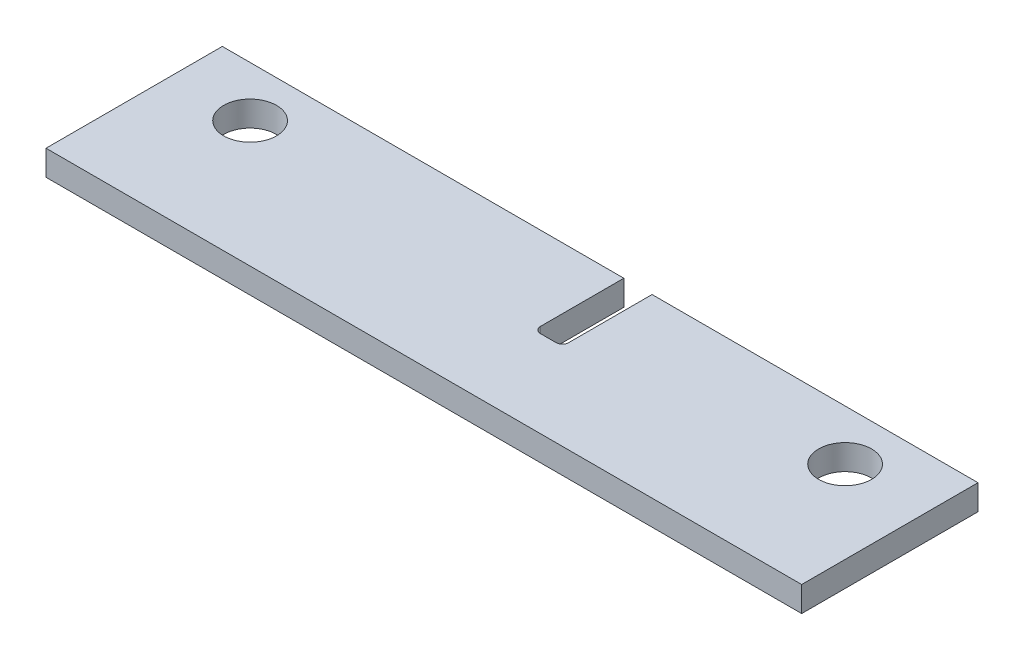
ISO-10303-21;
HEADER;
FILE_DESCRIPTION(('STEP AP214'),'2;1');
FILE_NAME('part.step','',(''),(''),'','','');
FILE_SCHEMA(('AUTOMOTIVE_DESIGN { 1 0 10303 214 1 1 1 1 }'));
ENDSEC;
DATA;
#1=APPLICATION_CONTEXT('core data for automotive mechanical design processes');
#2=APPLICATION_PROTOCOL_DEFINITION('international standard','automotive_design',2000,#1);
#3=PRODUCT_CONTEXT('',#1,'mechanical');
#4=PRODUCT('Part','Part','',(#3));
#5=PRODUCT_RELATED_PRODUCT_CATEGORY('part','',(#4));
#6=PRODUCT_DEFINITION_FORMATION('','',#4);
#7=PRODUCT_DEFINITION_CONTEXT('part definition',#1,'design');
#8=PRODUCT_DEFINITION('design','',#6,#7);
#9=PRODUCT_DEFINITION_SHAPE('','',#8);
#10=(LENGTH_UNIT() NAMED_UNIT(*) SI_UNIT(.MILLI.,.METRE.));
#11=(NAMED_UNIT(*) PLANE_ANGLE_UNIT() SI_UNIT($,.RADIAN.));
#12=(NAMED_UNIT(*) SI_UNIT($,.STERADIAN.) SOLID_ANGLE_UNIT());
#13=UNCERTAINTY_MEASURE_WITH_UNIT(LENGTH_MEASURE(1.E-05),#10,'distance_accuracy_value','');
#14=(GEOMETRIC_REPRESENTATION_CONTEXT(3) GLOBAL_UNCERTAINTY_ASSIGNED_CONTEXT((#13)) GLOBAL_UNIT_ASSIGNED_CONTEXT((#10,
#11,#12)) REPRESENTATION_CONTEXT('',''));
#15=CARTESIAN_POINT('',(0.,0.,0.));
#16=DIRECTION('',(0.,0.,1.));
#17=DIRECTION('',(1.,0.,0.));
#18=AXIS2_PLACEMENT_3D('',#15,#16,#17);
#19=CARTESIAN_POINT('',(0.,0.,249.6));
#20=DIRECTION('',(0.,0.,-1.));
#21=DIRECTION('',(-1.,0.,0.));
#22=AXIS2_PLACEMENT_3D('',#19,#20,#21);
#23=PLANE('',#22);
#24=DIRECTION('',(0.,1.,0.));
#25=VECTOR('',#24,1.);
#26=CARTESIAN_POINT('',(2477.262,115.8,249.6));
#27=LINE('',#26,#25);
#28=CARTESIAN_POINT('',(2477.262,115.8,249.6));
#29=VERTEX_POINT('',#28);
#30=CARTESIAN_POINT('',(2477.262,128.5,249.6));
#31=VERTEX_POINT('',#30);
#32=EDGE_CURVE('E156',#29,#31,#27,.T.);
#33=ORIENTED_EDGE('',*,*,#32,.T.);
#34=DIRECTION('',(-1.,0.,0.));
#35=VECTOR('',#34,1.);
#36=CARTESIAN_POINT('',(2260.6,128.5,249.6));
#37=LINE('',#36,#35);
#38=CARTESIAN_POINT('',(2641.6,128.5,249.6));
#39=VERTEX_POINT('',#38);
#40=EDGE_CURVE('E134',#39,#31,#37,.T.);
#41=ORIENTED_EDGE('',*,*,#40,.F.);
#42=DIRECTION('',(0.,1.,0.));
#43=VECTOR('',#42,1.);
#44=CARTESIAN_POINT('',(2641.6,115.8,249.6));
#45=LINE('',#44,#43);
#46=CARTESIAN_POINT('',(2641.6,115.8,249.6));
#47=VERTEX_POINT('',#46);
#48=EDGE_CURVE('E181',#47,#39,#45,.T.);
#49=ORIENTED_EDGE('',*,*,#48,.F.);
#50=DIRECTION('',(1.,0.,0.));
#51=VECTOR('',#50,1.);
#52=CARTESIAN_POINT('',(2260.6,115.8,249.6));
#53=LINE('',#52,#51);
#54=EDGE_CURVE('E204',#29,#47,#53,.T.);
#55=ORIENTED_EDGE('',*,*,#54,.F.);
#56=EDGE_LOOP('',(#33,#41,#49,#55));
#57=FACE_BOUND('',#56,.T.);
#58=ADVANCED_FACE('F45',(#57),#23,.T.);
#59=CARTESIAN_POINT('',(2260.6,115.8,249.6));
#60=DIRECTION('',(-1.,0.,0.));
#61=DIRECTION('',(0.,0.,1.));
#62=AXIS2_PLACEMENT_3D('',#59,#60,#61);
#63=PLANE('',#62);
#64=DIRECTION('',(0.,0.,1.));
#65=VECTOR('',#64,1.);
#66=CARTESIAN_POINT('',(2260.6,115.8,249.6));
#67=LINE('',#66,#65);
#68=CARTESIAN_POINT('',(2260.6,115.8,249.6));
#69=VERTEX_POINT('',#68);
#70=CARTESIAN_POINT('',(2260.6,115.8,338.5));
#71=VERTEX_POINT('',#70);
#72=EDGE_CURVE('E150',#69,#71,#67,.T.);
#73=ORIENTED_EDGE('',*,*,#72,.T.);
#74=DIRECTION('',(0.,-1.,0.));
#75=VECTOR('',#74,1.);
#76=CARTESIAN_POINT('',(2260.6,115.8,338.5));
#77=LINE('',#76,#75);
#78=CARTESIAN_POINT('',(2260.6,128.5,338.5));
#79=VERTEX_POINT('',#78);
#80=EDGE_CURVE('E141',#79,#71,#77,.T.);
#81=ORIENTED_EDGE('',*,*,#80,.F.);
#82=DIRECTION('',(0.,0.,1.));
#83=VECTOR('',#82,1.);
#84=CARTESIAN_POINT('',(2260.6,128.5,249.6));
#85=LINE('',#84,#83);
#86=CARTESIAN_POINT('',(2260.6,128.5,249.6));
#87=VERTEX_POINT('',#86);
#88=EDGE_CURVE('E125',#87,#79,#85,.T.);
#89=ORIENTED_EDGE('',*,*,#88,.F.);
#90=DIRECTION('',(0.,-1.,0.));
#91=VECTOR('',#90,1.);
#92=CARTESIAN_POINT('',(2260.6,115.8,249.6));
#93=LINE('',#92,#91);
#94=EDGE_CURVE('E139',#87,#69,#93,.T.);
#95=ORIENTED_EDGE('',*,*,#94,.T.);
#96=EDGE_LOOP('',(#73,#81,#89,#95));
#97=FACE_BOUND('',#96,.T.);
#98=ADVANCED_FACE('F138',(#97),#63,.T.);
#99=CARTESIAN_POINT('',(2260.6,128.5,249.6));
#100=DIRECTION('',(0.,1.,0.));
#101=DIRECTION('',(0.,0.,1.));
#102=AXIS2_PLACEMENT_3D('',#99,#100,#101);
#103=PLANE('',#102);
#104=CARTESIAN_POINT('',(2599.99999999996,128.5,275.));
#105=DIRECTION('',(0.,1.,0.));
#106=DIRECTION('',(0.,0.,1.));
#107=AXIS2_PLACEMENT_3D('',#104,#105,#106);
#108=CIRCLE('',#107,13.3349999999999);
#109=CARTESIAN_POINT('',(2599.99999999996,128.5,261.665));
#110=VERTEX_POINT('',#109);
#111=EDGE_CURVE('E149',#110,#110,#108,.F.);
#112=ORIENTED_EDGE('',*,*,#111,.T.);
#113=EDGE_LOOP('',(#112));
#114=FACE_BOUND('',#113,.T.);
#115=CARTESIAN_POINT('',(2299.99999999996,128.5,275.));
#116=DIRECTION('',(0.,1.,0.));
#117=DIRECTION('',(0.,0.,1.));
#118=AXIS2_PLACEMENT_3D('',#115,#116,#117);
#119=CIRCLE('',#118,13.3349999999999);
#120=CARTESIAN_POINT('',(2299.99999999996,128.5,261.665));
#121=VERTEX_POINT('',#120);
#122=EDGE_CURVE('E132',#121,#121,#119,.F.);
#123=ORIENTED_EDGE('',*,*,#122,.T.);
#124=EDGE_LOOP('',(#123));
#125=FACE_BOUND('',#124,.T.);
#126=DIRECTION('',(0.,0.,-1.));
#127=VECTOR('',#126,1.);
#128=CARTESIAN_POINT('',(2477.262,128.5,249.6));
#129=LINE('',#128,#127);
#130=CARTESIAN_POINT('',(2477.262,128.5,291.637));
#131=VERTEX_POINT('',#130);
#132=EDGE_CURVE('E164',#131,#31,#129,.T.);
#133=ORIENTED_EDGE('',*,*,#132,.F.);
#134=CARTESIAN_POINT('',(2474.087,128.5,291.637));
#135=DIRECTION('',(0.,1.,0.));
#136=DIRECTION('',(0.,0.,1.));
#137=AXIS2_PLACEMENT_3D('',#134,#135,#136);
#138=CIRCLE('',#137,3.175);
#139=CARTESIAN_POINT('',(2474.087,128.5,294.812));
#140=VERTEX_POINT('',#139);
#141=EDGE_CURVE('E225',#131,#140,#138,.F.);
#142=ORIENTED_EDGE('',*,*,#141,.T.);
#143=DIRECTION('',(1.,0.,0.));
#144=VECTOR('',#143,1.);
#145=CARTESIAN_POINT('',(2260.6,128.5,294.812000000001));
#146=LINE('',#145,#144);
#147=CARTESIAN_POINT('',(2466.213,128.5,294.812));
#148=VERTEX_POINT('',#147);
#149=EDGE_CURVE('E192',#148,#140,#146,.T.);
#150=ORIENTED_EDGE('',*,*,#149,.F.);
#151=CARTESIAN_POINT('',(2466.213,128.5,291.637));
#152=DIRECTION('',(0.,1.,0.));
#153=DIRECTION('',(0.,0.,1.));
#154=AXIS2_PLACEMENT_3D('',#151,#152,#153);
#155=CIRCLE('',#154,3.175);
#156=CARTESIAN_POINT('',(2463.038,128.5,291.637));
#157=VERTEX_POINT('',#156);
#158=EDGE_CURVE('E54',#148,#157,#155,.F.);
#159=ORIENTED_EDGE('',*,*,#158,.T.);
#160=DIRECTION('',(0.,0.,1.));
#161=VECTOR('',#160,1.);
#162=CARTESIAN_POINT('',(2463.038,128.5,249.6));
#163=LINE('',#162,#161);
#164=CARTESIAN_POINT('',(2463.038,128.5,249.6));
#165=VERTEX_POINT('',#164);
#166=EDGE_CURVE('E127',#165,#157,#163,.T.);
#167=ORIENTED_EDGE('',*,*,#166,.F.);
#168=EDGE_CURVE('E120',#165,#87,#37,.T.);
#169=ORIENTED_EDGE('',*,*,#168,.T.);
#170=ORIENTED_EDGE('',*,*,#88,.T.);
#171=DIRECTION('',(-1.,0.,0.));
#172=VECTOR('',#171,1.);
#173=CARTESIAN_POINT('',(2260.6,128.5,338.5));
#174=LINE('',#173,#172);
#175=CARTESIAN_POINT('',(2641.6,128.5,338.5));
#176=VERTEX_POINT('',#175);
#177=EDGE_CURVE('E161',#176,#79,#174,.T.);
#178=ORIENTED_EDGE('',*,*,#177,.F.);
#179=DIRECTION('',(0.,0.,1.));
#180=VECTOR('',#179,1.);
#181=CARTESIAN_POINT('',(2641.6,128.5,249.6));
#182=LINE('',#181,#180);
#183=EDGE_CURVE('E239',#39,#176,#182,.T.);
#184=ORIENTED_EDGE('',*,*,#183,.F.);
#185=ORIENTED_EDGE('',*,*,#40,.T.);
#186=EDGE_LOOP('',(#133,#142,#150,#159,#167,#169,#170,#178,#184,#185));
#187=FACE_BOUND('',#186,.T.);
#188=ADVANCED_FACE('F123',(#114,#125,#187),#103,.T.);
#189=CARTESIAN_POINT('',(2641.6,115.8,249.6));
#190=DIRECTION('',(1.,0.,0.));
#191=DIRECTION('',(0.,0.,-1.));
#192=AXIS2_PLACEMENT_3D('',#189,#190,#191);
#193=PLANE('',#192);
#194=ORIENTED_EDGE('',*,*,#183,.T.);
#195=DIRECTION('',(0.,1.,0.));
#196=VECTOR('',#195,1.);
#197=CARTESIAN_POINT('',(2641.6,115.8,338.5));
#198=LINE('',#197,#196);
#199=CARTESIAN_POINT('',(2641.6,115.8,338.5));
#200=VERTEX_POINT('',#199);
#201=EDGE_CURVE('E165',#200,#176,#198,.T.);
#202=ORIENTED_EDGE('',*,*,#201,.F.);
#203=DIRECTION('',(0.,0.,1.));
#204=VECTOR('',#203,1.);
#205=CARTESIAN_POINT('',(2641.6,115.8,249.6));
#206=LINE('',#205,#204);
#207=EDGE_CURVE('E233',#47,#200,#206,.T.);
#208=ORIENTED_EDGE('',*,*,#207,.F.);
#209=ORIENTED_EDGE('',*,*,#48,.T.);
#210=EDGE_LOOP('',(#194,#202,#208,#209));
#211=FACE_BOUND('',#210,.T.);
#212=ADVANCED_FACE('F291',(#211),#193,.T.);
#213=CARTESIAN_POINT('',(2260.6,115.8,249.6));
#214=DIRECTION('',(0.,-1.,0.));
#215=DIRECTION('',(0.,0.,-1.));
#216=AXIS2_PLACEMENT_3D('',#213,#214,#215);
#217=PLANE('',#216);
#218=CARTESIAN_POINT('',(2599.99999999996,115.8,275.));
#219=DIRECTION('',(0.,-1.,0.));
#220=DIRECTION('',(0.,0.,-1.));
#221=AXIS2_PLACEMENT_3D('',#218,#219,#220);
#222=CIRCLE('',#221,13.3349999999999);
#223=CARTESIAN_POINT('',(2599.99999999996,115.8,261.665));
#224=VERTEX_POINT('',#223);
#225=EDGE_CURVE('E176',#224,#224,#222,.F.);
#226=ORIENTED_EDGE('',*,*,#225,.T.);
#227=EDGE_LOOP('',(#226));
#228=FACE_BOUND('',#227,.T.);
#229=CARTESIAN_POINT('',(2299.99999999996,115.8,275.));
#230=DIRECTION('',(0.,-1.,0.));
#231=DIRECTION('',(0.,0.,-1.));
#232=AXIS2_PLACEMENT_3D('',#229,#230,#231);
#233=CIRCLE('',#232,13.3349999999999);
#234=CARTESIAN_POINT('',(2299.99999999996,115.8,261.665));
#235=VERTEX_POINT('',#234);
#236=EDGE_CURVE('E180',#235,#235,#233,.F.);
#237=ORIENTED_EDGE('',*,*,#236,.T.);
#238=EDGE_LOOP('',(#237));
#239=FACE_BOUND('',#238,.T.);
#240=DIRECTION('',(1.,0.,0.));
#241=VECTOR('',#240,1.);
#242=CARTESIAN_POINT('',(2476.5,115.8,294.812));
#243=LINE('',#242,#241);
#244=CARTESIAN_POINT('',(2466.213,115.8,294.812));
#245=VERTEX_POINT('',#244);
#246=CARTESIAN_POINT('',(2474.087,115.8,294.812));
#247=VERTEX_POINT('',#246);
#248=EDGE_CURVE('E174',#245,#247,#243,.T.);
#249=ORIENTED_EDGE('',*,*,#248,.T.);
#250=CARTESIAN_POINT('',(2474.087,115.8,291.637));
#251=DIRECTION('',(0.,-1.,0.));
#252=DIRECTION('',(0.,0.,-1.));
#253=AXIS2_PLACEMENT_3D('',#250,#251,#252);
#254=CIRCLE('',#253,3.175);
#255=CARTESIAN_POINT('',(2477.262,115.8,291.637));
#256=VERTEX_POINT('',#255);
#257=EDGE_CURVE('E228',#247,#256,#254,.F.);
#258=ORIENTED_EDGE('',*,*,#257,.T.);
#259=DIRECTION('',(0.,0.,-1.));
#260=VECTOR('',#259,1.);
#261=CARTESIAN_POINT('',(2477.262,115.8,249.6));
#262=LINE('',#261,#260);
#263=EDGE_CURVE('E188',#256,#29,#262,.T.);
#264=ORIENTED_EDGE('',*,*,#263,.T.);
#265=ORIENTED_EDGE('',*,*,#54,.T.);
#266=ORIENTED_EDGE('',*,*,#207,.T.);
#267=DIRECTION('',(1.,0.,0.));
#268=VECTOR('',#267,1.);
#269=CARTESIAN_POINT('',(2260.6,115.8,338.5));
#270=LINE('',#269,#268);
#271=EDGE_CURVE('E169',#71,#200,#270,.T.);
#272=ORIENTED_EDGE('',*,*,#271,.F.);
#273=ORIENTED_EDGE('',*,*,#72,.F.);
#274=CARTESIAN_POINT('',(2463.038,115.8,249.6));
#275=VERTEX_POINT('',#274);
#276=EDGE_CURVE('E147',#69,#275,#53,.T.);
#277=ORIENTED_EDGE('',*,*,#276,.T.);
#278=DIRECTION('',(0.,0.,1.));
#279=VECTOR('',#278,1.);
#280=CARTESIAN_POINT('',(2463.038,115.8,294.05));
#281=LINE('',#280,#279);
#282=CARTESIAN_POINT('',(2463.038,115.8,291.637));
#283=VERTEX_POINT('',#282);
#284=EDGE_CURVE('E196',#275,#283,#281,.T.);
#285=ORIENTED_EDGE('',*,*,#284,.T.);
#286=CARTESIAN_POINT('',(2466.213,115.8,291.637));
#287=DIRECTION('',(0.,-1.,0.));
#288=DIRECTION('',(0.,0.,-1.));
#289=AXIS2_PLACEMENT_3D('',#286,#287,#288);
#290=CIRCLE('',#289,3.175);
#291=EDGE_CURVE('E12',#283,#245,#290,.F.);
#292=ORIENTED_EDGE('',*,*,#291,.T.);
#293=EDGE_LOOP('',(#249,#258,#264,#265,#266,#272,#273,#277,#285,#292));
#294=FACE_BOUND('',#293,.T.);
#295=ADVANCED_FACE('F263',(#228,#239,#294),#217,.T.);
#296=DIRECTION('',(0.,1.,0.));
#297=VECTOR('',#296,1.);
#298=CARTESIAN_POINT('',(2463.038,0.,249.6));
#299=LINE('',#298,#297);
#300=EDGE_CURVE('E191',#275,#165,#299,.T.);
#301=ORIENTED_EDGE('',*,*,#300,.F.);
#302=ORIENTED_EDGE('',*,*,#276,.F.);
#303=ORIENTED_EDGE('',*,*,#94,.F.);
#304=ORIENTED_EDGE('',*,*,#168,.F.);
#305=EDGE_LOOP('',(#301,#302,#303,#304));
#306=FACE_BOUND('',#305,.T.);
#307=ADVANCED_FACE('F145',(#306),#23,.T.);
#308=CARTESIAN_POINT('',(0.,0.,338.5));
#309=DIRECTION('',(0.,0.,-1.));
#310=DIRECTION('',(-1.,0.,0.));
#311=AXIS2_PLACEMENT_3D('',#308,#309,#310);
#312=PLANE('',#311);
#313=ORIENTED_EDGE('',*,*,#80,.T.);
#314=ORIENTED_EDGE('',*,*,#271,.T.);
#315=ORIENTED_EDGE('',*,*,#201,.T.);
#316=ORIENTED_EDGE('',*,*,#177,.T.);
#317=EDGE_LOOP('',(#313,#314,#315,#316));
#318=FACE_BOUND('',#317,.T.);
#319=ADVANCED_FACE('F285',(#318),#312,.F.);
#320=CARTESIAN_POINT('',(2477.262,115.8,249.6));
#321=DIRECTION('',(1.,0.,0.));
#322=DIRECTION('',(0.,0.,-1.));
#323=AXIS2_PLACEMENT_3D('',#320,#321,#322);
#324=PLANE('',#323);
#325=ORIENTED_EDGE('',*,*,#263,.F.);
#326=DIRECTION('',(0.,1.,0.));
#327=VECTOR('',#326,1.);
#328=CARTESIAN_POINT('',(2477.262,128.5,291.637));
#329=LINE('',#328,#327);
#330=EDGE_CURVE('E195',#256,#131,#329,.T.);
#331=ORIENTED_EDGE('',*,*,#330,.T.);
#332=ORIENTED_EDGE('',*,*,#132,.T.);
#333=ORIENTED_EDGE('',*,*,#32,.F.);
#334=EDGE_LOOP('',(#325,#331,#332,#333));
#335=FACE_BOUND('',#334,.T.);
#336=ADVANCED_FACE('F250',(#335),#324,.F.);
#337=CARTESIAN_POINT('',(2476.5,115.8,294.812));
#338=DIRECTION('',(0.,0.,1.));
#339=DIRECTION('',(1.,0.,0.));
#340=AXIS2_PLACEMENT_3D('',#337,#338,#339);
#341=PLANE('',#340);
#342=ORIENTED_EDGE('',*,*,#149,.T.);
#343=DIRECTION('',(0.,1.,0.));
#344=VECTOR('',#343,1.);
#345=CARTESIAN_POINT('',(2474.087,115.8,294.812));
#346=LINE('',#345,#344);
#347=EDGE_CURVE('E220',#140,#247,#346,.F.);
#348=ORIENTED_EDGE('',*,*,#347,.T.);
#349=ORIENTED_EDGE('',*,*,#248,.F.);
#350=DIRECTION('',(0.,1.,0.));
#351=VECTOR('',#350,1.);
#352=CARTESIAN_POINT('',(2466.213,128.5,294.812));
#353=LINE('',#352,#351);
#354=EDGE_CURVE('E216',#245,#148,#353,.T.);
#355=ORIENTED_EDGE('',*,*,#354,.T.);
#356=EDGE_LOOP('',(#342,#348,#349,#355));
#357=FACE_BOUND('',#356,.T.);
#358=ADVANCED_FACE('F257',(#357),#341,.F.);
#359=CARTESIAN_POINT('',(2463.038,115.8,294.05));
#360=DIRECTION('',(-1.,0.,0.));
#361=DIRECTION('',(0.,0.,1.));
#362=AXIS2_PLACEMENT_3D('',#359,#360,#361);
#363=PLANE('',#362);
#364=ORIENTED_EDGE('',*,*,#166,.T.);
#365=DIRECTION('',(0.,1.,0.));
#366=VECTOR('',#365,1.);
#367=CARTESIAN_POINT('',(2463.038,115.8,291.637));
#368=LINE('',#367,#366);
#369=EDGE_CURVE('E61',#157,#283,#368,.F.);
#370=ORIENTED_EDGE('',*,*,#369,.T.);
#371=ORIENTED_EDGE('',*,*,#284,.F.);
#372=ORIENTED_EDGE('',*,*,#300,.T.);
#373=EDGE_LOOP('',(#364,#370,#371,#372));
#374=FACE_BOUND('',#373,.T.);
#375=ADVANCED_FACE('F264',(#374),#363,.F.);
#376=CARTESIAN_POINT('',(2299.99999999996,181.249999999996,275.));
#377=DIRECTION('',(0.,-1.,0.));
#378=DIRECTION('',(0.,0.,-1.));
#379=AXIS2_PLACEMENT_3D('',#376,#377,#378);
#380=CYLINDRICAL_SURFACE('',#379,13.3349999999999);
#381=CARTESIAN_POINT('',(2299.99999999996,128.5,261.665));
#382=CARTESIAN_POINT('',(2299.99999999996,128.367708333333,261.665));
#383=CARTESIAN_POINT('',(2299.99999999996,128.235416666667,261.665));
#384=CARTESIAN_POINT('',(2299.99999999996,127.970833333333,261.665));
#385=CARTESIAN_POINT('',(2299.99999999996,127.838541666667,261.665));
#386=CARTESIAN_POINT('',(2299.99999999996,127.573958333333,261.665));
#387=CARTESIAN_POINT('',(2299.99999999996,127.441666666667,261.665));
#388=CARTESIAN_POINT('',(2299.99999999996,127.177083333333,261.665));
#389=CARTESIAN_POINT('',(2299.99999999996,127.044791666667,261.665));
#390=CARTESIAN_POINT('',(2299.99999999996,126.780208333333,261.665));
#391=CARTESIAN_POINT('',(2299.99999999996,126.647916666667,261.665));
#392=CARTESIAN_POINT('',(2299.99999999996,126.383333333333,261.665));
#393=CARTESIAN_POINT('',(2299.99999999996,126.251041666667,261.665));
#394=CARTESIAN_POINT('',(2299.99999999996,125.986458333333,261.665));
#395=CARTESIAN_POINT('',(2299.99999999996,125.854166666667,261.665));
#396=CARTESIAN_POINT('',(2299.99999999996,125.589583333333,261.665));
#397=CARTESIAN_POINT('',(2299.99999999996,125.457291666667,261.665));
#398=CARTESIAN_POINT('',(2299.99999999996,125.192708333333,261.665));
#399=CARTESIAN_POINT('',(2299.99999999996,125.060416666667,261.665));
#400=CARTESIAN_POINT('',(2299.99999999996,124.795833333333,261.665));
#401=CARTESIAN_POINT('',(2299.99999999996,124.663541666667,261.665));
#402=CARTESIAN_POINT('',(2299.99999999996,124.398958333333,261.665));
#403=CARTESIAN_POINT('',(2299.99999999996,124.266666666667,261.665));
#404=CARTESIAN_POINT('',(2299.99999999996,124.002083333333,261.665));
#405=CARTESIAN_POINT('',(2299.99999999996,123.869791666667,261.665));
#406=CARTESIAN_POINT('',(2299.99999999996,123.605208333333,261.665));
#407=CARTESIAN_POINT('',(2299.99999999996,123.472916666667,261.665));
#408=CARTESIAN_POINT('',(2299.99999999996,123.208333333333,261.665));
#409=CARTESIAN_POINT('',(2299.99999999996,123.076041666667,261.665));
#410=CARTESIAN_POINT('',(2299.99999999996,122.811458333333,261.665));
#411=CARTESIAN_POINT('',(2299.99999999996,122.679166666667,261.665));
#412=CARTESIAN_POINT('',(2299.99999999996,122.414583333333,261.665));
#413=CARTESIAN_POINT('',(2299.99999999996,122.282291666667,261.665));
#414=CARTESIAN_POINT('',(2299.99999999996,122.017708333333,261.665));
#415=CARTESIAN_POINT('',(2299.99999999996,121.885416666667,261.665));
#416=CARTESIAN_POINT('',(2299.99999999996,121.620833333333,261.665));
#417=CARTESIAN_POINT('',(2299.99999999996,121.488541666667,261.665));
#418=CARTESIAN_POINT('',(2299.99999999996,121.223958333333,261.665));
#419=CARTESIAN_POINT('',(2299.99999999996,121.091666666667,261.665));
#420=CARTESIAN_POINT('',(2299.99999999996,120.827083333333,261.665));
#421=CARTESIAN_POINT('',(2299.99999999996,120.694791666667,261.665));
#422=CARTESIAN_POINT('',(2299.99999999996,120.430208333333,261.665));
#423=CARTESIAN_POINT('',(2299.99999999996,120.297916666667,261.665));
#424=CARTESIAN_POINT('',(2299.99999999996,120.033333333333,261.665));
#425=CARTESIAN_POINT('',(2299.99999999996,119.901041666667,261.665));
#426=CARTESIAN_POINT('',(2299.99999999996,119.636458333333,261.665));
#427=CARTESIAN_POINT('',(2299.99999999996,119.504166666667,261.665));
#428=CARTESIAN_POINT('',(2299.99999999996,119.239583333333,261.665));
#429=CARTESIAN_POINT('',(2299.99999999996,119.107291666667,261.665));
#430=CARTESIAN_POINT('',(2299.99999999996,118.842708333333,261.665));
#431=CARTESIAN_POINT('',(2299.99999999996,118.710416666667,261.665));
#432=CARTESIAN_POINT('',(2299.99999999996,118.445833333333,261.665));
#433=CARTESIAN_POINT('',(2299.99999999996,118.313541666667,261.665));
#434=CARTESIAN_POINT('',(2299.99999999996,118.048958333333,261.665));
#435=CARTESIAN_POINT('',(2299.99999999996,117.916666666667,261.665));
#436=CARTESIAN_POINT('',(2299.99999999996,117.652083333333,261.665));
#437=CARTESIAN_POINT('',(2299.99999999996,117.519791666667,261.665));
#438=CARTESIAN_POINT('',(2299.99999999996,117.255208333333,261.665));
#439=CARTESIAN_POINT('',(2299.99999999996,117.122916666667,261.665));
#440=CARTESIAN_POINT('',(2299.99999999996,116.858333333333,261.665));
#441=CARTESIAN_POINT('',(2299.99999999996,116.726041666667,261.665));
#442=CARTESIAN_POINT('',(2299.99999999996,116.461458333333,261.665));
#443=CARTESIAN_POINT('',(2299.99999999996,116.329166666667,261.665));
#444=CARTESIAN_POINT('',(2299.99999999996,116.064583333333,261.665));
#445=CARTESIAN_POINT('',(2299.99999999996,115.932291666667,261.665));
#446=CARTESIAN_POINT('',(2299.99999999996,115.8,261.665));
#447=B_SPLINE_CURVE_WITH_KNOTS('',3,(#381,#382,#383,#384,#385,#386,#387,#388,#389,#390,#391,
#392,#393,#394,#395,#396,#397,#398,#399,#400,#401,#402,#403,#404,#405,#406,#407,#408,#409,#410,
#411,#412,#413,#414,#415,#416,#417,#418,#419,#420,#421,#422,#423,#424,#425,#426,#427,#428,#429,
#430,#431,#432,#433,#434,#435,#436,#437,#438,#439,#440,#441,#442,#443,#444,#445,#446),
.UNSPECIFIED.,.F.,.F.,(4,2,2,2,2,2,2,2,2,2,2,2,2,2,2,2,2,2,2,2,2,2,2,2,2,2,2,2,2,2,2,2,4),(0.,
0.396874999999991,0.793749999999982,1.190625,1.58749999999999,1.98437499999998,2.38124999999997,
2.77812499999996,3.17499999999998,3.57187499999997,3.96874999999998,4.36562499999998,
4.76249999999998,5.15937499999998,5.55624999999998,5.95312499999998,6.34999999999997,
6.74687499999997,7.14374999999998,7.54062499999997,7.93749999999997,8.33437499999998,
8.73124999999997,9.12812499999996,9.52499999999996,9.92187499999997,10.31875,10.715625,11.1125,
11.509375,11.90625,12.303125,12.7),.UNSPECIFIED.);
#448=EDGE_CURVE('BSEAM266',#121,#235,#447,.T.);
#449=ORIENTED_EDGE('',*,*,#122,.F.);
#450=ORIENTED_EDGE('',*,*,#236,.F.);
#451=ORIENTED_EDGE('',*,*,#448,.T.);
#452=ORIENTED_EDGE('',*,*,#448,.F.);
#453=EDGE_LOOP('',(#449,#451,#450,#452));
#454=FACE_BOUND('',#453,.T.);
#455=ADVANCED_FACE('F266',(#454),#380,.F.);
#456=CARTESIAN_POINT('',(2599.99999999996,289.999999999996,275.));
#457=DIRECTION('',(0.,-1.,0.));
#458=DIRECTION('',(0.,0.,-1.));
#459=AXIS2_PLACEMENT_3D('',#456,#457,#458);
#460=CYLINDRICAL_SURFACE('',#459,13.3349999999999);
#461=CARTESIAN_POINT('',(2599.99999999996,128.5,261.665));
#462=CARTESIAN_POINT('',(2599.99999999996,128.367708333333,261.665));
#463=CARTESIAN_POINT('',(2599.99999999996,128.235416666667,261.665));
#464=CARTESIAN_POINT('',(2599.99999999996,127.970833333333,261.665));
#465=CARTESIAN_POINT('',(2599.99999999996,127.838541666667,261.665));
#466=CARTESIAN_POINT('',(2599.99999999996,127.573958333333,261.665));
#467=CARTESIAN_POINT('',(2599.99999999996,127.441666666667,261.665));
#468=CARTESIAN_POINT('',(2599.99999999996,127.177083333333,261.665));
#469=CARTESIAN_POINT('',(2599.99999999996,127.044791666667,261.665));
#470=CARTESIAN_POINT('',(2599.99999999996,126.780208333333,261.665));
#471=CARTESIAN_POINT('',(2599.99999999996,126.647916666667,261.665));
#472=CARTESIAN_POINT('',(2599.99999999996,126.383333333333,261.665));
#473=CARTESIAN_POINT('',(2599.99999999996,126.251041666667,261.665));
#474=CARTESIAN_POINT('',(2599.99999999996,125.986458333333,261.665));
#475=CARTESIAN_POINT('',(2599.99999999996,125.854166666667,261.665));
#476=CARTESIAN_POINT('',(2599.99999999996,125.589583333333,261.665));
#477=CARTESIAN_POINT('',(2599.99999999996,125.457291666667,261.665));
#478=CARTESIAN_POINT('',(2599.99999999996,125.192708333333,261.665));
#479=CARTESIAN_POINT('',(2599.99999999996,125.060416666667,261.665));
#480=CARTESIAN_POINT('',(2599.99999999996,124.795833333333,261.665));
#481=CARTESIAN_POINT('',(2599.99999999996,124.663541666667,261.665));
#482=CARTESIAN_POINT('',(2599.99999999996,124.398958333333,261.665));
#483=CARTESIAN_POINT('',(2599.99999999996,124.266666666667,261.665));
#484=CARTESIAN_POINT('',(2599.99999999996,124.002083333333,261.665));
#485=CARTESIAN_POINT('',(2599.99999999996,123.869791666667,261.665));
#486=CARTESIAN_POINT('',(2599.99999999996,123.605208333333,261.665));
#487=CARTESIAN_POINT('',(2599.99999999996,123.472916666667,261.665));
#488=CARTESIAN_POINT('',(2599.99999999996,123.208333333333,261.665));
#489=CARTESIAN_POINT('',(2599.99999999996,123.076041666667,261.665));
#490=CARTESIAN_POINT('',(2599.99999999996,122.811458333333,261.665));
#491=CARTESIAN_POINT('',(2599.99999999996,122.679166666667,261.665));
#492=CARTESIAN_POINT('',(2599.99999999996,122.414583333333,261.665));
#493=CARTESIAN_POINT('',(2599.99999999996,122.282291666667,261.665));
#494=CARTESIAN_POINT('',(2599.99999999996,122.017708333333,261.665));
#495=CARTESIAN_POINT('',(2599.99999999996,121.885416666667,261.665));
#496=CARTESIAN_POINT('',(2599.99999999996,121.620833333333,261.665));
#497=CARTESIAN_POINT('',(2599.99999999996,121.488541666667,261.665));
#498=CARTESIAN_POINT('',(2599.99999999996,121.223958333333,261.665));
#499=CARTESIAN_POINT('',(2599.99999999996,121.091666666667,261.665));
#500=CARTESIAN_POINT('',(2599.99999999996,120.827083333333,261.665));
#501=CARTESIAN_POINT('',(2599.99999999996,120.694791666667,261.665));
#502=CARTESIAN_POINT('',(2599.99999999996,120.430208333333,261.665));
#503=CARTESIAN_POINT('',(2599.99999999996,120.297916666667,261.665));
#504=CARTESIAN_POINT('',(2599.99999999996,120.033333333333,261.665));
#505=CARTESIAN_POINT('',(2599.99999999996,119.901041666667,261.665));
#506=CARTESIAN_POINT('',(2599.99999999996,119.636458333333,261.665));
#507=CARTESIAN_POINT('',(2599.99999999996,119.504166666667,261.665));
#508=CARTESIAN_POINT('',(2599.99999999996,119.239583333333,261.665));
#509=CARTESIAN_POINT('',(2599.99999999996,119.107291666667,261.665));
#510=CARTESIAN_POINT('',(2599.99999999996,118.842708333333,261.665));
#511=CARTESIAN_POINT('',(2599.99999999996,118.710416666667,261.665));
#512=CARTESIAN_POINT('',(2599.99999999996,118.445833333333,261.665));
#513=CARTESIAN_POINT('',(2599.99999999996,118.313541666667,261.665));
#514=CARTESIAN_POINT('',(2599.99999999996,118.048958333333,261.665));
#515=CARTESIAN_POINT('',(2599.99999999996,117.916666666667,261.665));
#516=CARTESIAN_POINT('',(2599.99999999996,117.652083333333,261.665));
#517=CARTESIAN_POINT('',(2599.99999999996,117.519791666667,261.665));
#518=CARTESIAN_POINT('',(2599.99999999996,117.255208333333,261.665));
#519=CARTESIAN_POINT('',(2599.99999999996,117.122916666667,261.665));
#520=CARTESIAN_POINT('',(2599.99999999996,116.858333333333,261.665));
#521=CARTESIAN_POINT('',(2599.99999999996,116.726041666667,261.665));
#522=CARTESIAN_POINT('',(2599.99999999996,116.461458333333,261.665));
#523=CARTESIAN_POINT('',(2599.99999999996,116.329166666667,261.665));
#524=CARTESIAN_POINT('',(2599.99999999996,116.064583333333,261.665));
#525=CARTESIAN_POINT('',(2599.99999999996,115.932291666667,261.665));
#526=CARTESIAN_POINT('',(2599.99999999996,115.8,261.665));
#527=B_SPLINE_CURVE_WITH_KNOTS('',3,(#461,#462,#463,#464,#465,#466,#467,#468,#469,#470,#471,
#472,#473,#474,#475,#476,#477,#478,#479,#480,#481,#482,#483,#484,#485,#486,#487,#488,#489,#490,
#491,#492,#493,#494,#495,#496,#497,#498,#499,#500,#501,#502,#503,#504,#505,#506,#507,#508,#509,
#510,#511,#512,#513,#514,#515,#516,#517,#518,#519,#520,#521,#522,#523,#524,#525,#526),
.UNSPECIFIED.,.F.,.F.,(4,2,2,2,2,2,2,2,2,2,2,2,2,2,2,2,2,2,2,2,2,2,2,2,2,2,2,2,2,2,2,2,4),(0.,
0.396874999999991,0.79375000000001,1.190625,1.58749999999999,1.98437500000001,2.38125,
2.77812499999999,3.17499999999998,3.571875,3.96874999999999,4.36562499999998,4.7625,
5.15937499999999,5.55624999999998,5.953125,6.34999999999999,6.74687499999999,7.14375,7.540625,
7.93749999999999,8.334375,8.73125,9.12812499999999,9.52500000000001,9.921875,10.31875,10.715625,
11.1125,11.509375,11.90625,12.303125,12.7),.UNSPECIFIED.);
#528=EDGE_CURVE('BSEAM272',#110,#224,#527,.T.);
#529=ORIENTED_EDGE('',*,*,#111,.F.);
#530=ORIENTED_EDGE('',*,*,#225,.F.);
#531=ORIENTED_EDGE('',*,*,#528,.T.);
#532=ORIENTED_EDGE('',*,*,#528,.F.);
#533=EDGE_LOOP('',(#529,#531,#530,#532));
#534=FACE_BOUND('',#533,.T.);
#535=ADVANCED_FACE('F272',(#534),#460,.F.);
#536=CARTESIAN_POINT('',(2474.087,115.8,291.637));
#537=DIRECTION('',(0.,-1.,0.));
#538=DIRECTION('',(0.,0.,-1.));
#539=AXIS2_PLACEMENT_3D('',#536,#537,#538);
#540=CYLINDRICAL_SURFACE('',#539,3.175);
#541=ORIENTED_EDGE('',*,*,#257,.F.);
#542=ORIENTED_EDGE('',*,*,#347,.F.);
#543=ORIENTED_EDGE('',*,*,#141,.F.);
#544=ORIENTED_EDGE('',*,*,#330,.F.);
#545=EDGE_LOOP('',(#541,#542,#543,#544));
#546=FACE_BOUND('',#545,.T.);
#547=ADVANCED_FACE('F254',(#546),#540,.F.);
#548=CARTESIAN_POINT('',(2466.213,115.8,291.637));
#549=DIRECTION('',(0.,-1.,0.));
#550=DIRECTION('',(0.,0.,-1.));
#551=AXIS2_PLACEMENT_3D('',#548,#549,#550);
#552=CYLINDRICAL_SURFACE('',#551,3.175);
#553=ORIENTED_EDGE('',*,*,#291,.F.);
#554=ORIENTED_EDGE('',*,*,#369,.F.);
#555=ORIENTED_EDGE('',*,*,#158,.F.);
#556=ORIENTED_EDGE('',*,*,#354,.F.);
#557=EDGE_LOOP('',(#553,#554,#555,#556));
#558=FACE_BOUND('',#557,.T.);
#559=ADVANCED_FACE('F47',(#558),#552,.F.);
#560=CLOSED_SHELL('',(#58,#98,#188,#212,#295,#307,#319,#336,#358,#375,#455,#535,#547,#559));
#561=MANIFOLD_SOLID_BREP('B2',#560);
#562=ADVANCED_BREP_SHAPE_REPRESENTATION('',(#18,#561),#14);
#563=SHAPE_DEFINITION_REPRESENTATION(#9,#562);
ENDSEC;
END-ISO-10303-21;
